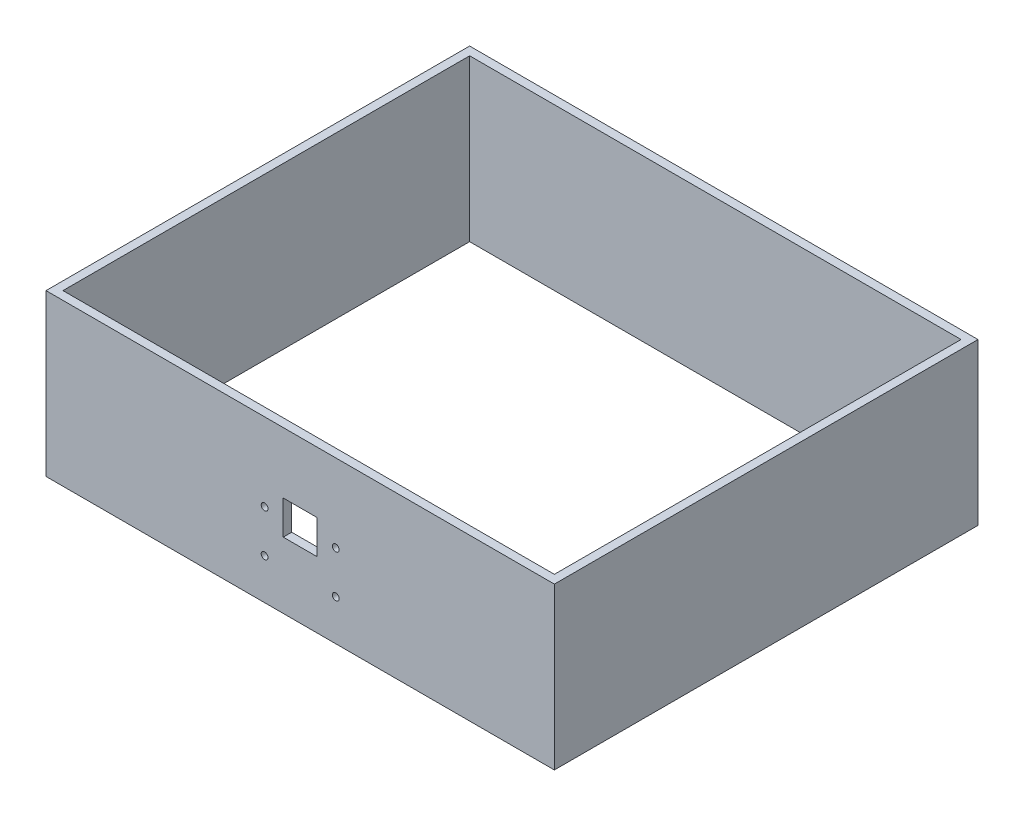
ISO-10303-21;
HEADER;
FILE_DESCRIPTION(('STEP AP214'),'2;1');
FILE_NAME('part.step','',(''),(''),'','','');
FILE_SCHEMA(('AUTOMOTIVE_DESIGN { 1 0 10303 214 1 1 1 1 }'));
ENDSEC;
DATA;
#1=APPLICATION_CONTEXT('core data for automotive mechanical design processes');
#2=APPLICATION_PROTOCOL_DEFINITION('international standard','automotive_design',2000,#1);
#3=PRODUCT_CONTEXT('',#1,'mechanical');
#4=PRODUCT('Part','Part','',(#3));
#5=PRODUCT_RELATED_PRODUCT_CATEGORY('part','',(#4));
#6=PRODUCT_DEFINITION_FORMATION('','',#4);
#7=PRODUCT_DEFINITION_CONTEXT('part definition',#1,'design');
#8=PRODUCT_DEFINITION('design','',#6,#7);
#9=PRODUCT_DEFINITION_SHAPE('','',#8);
#10=(LENGTH_UNIT() NAMED_UNIT(*) SI_UNIT(.MILLI.,.METRE.));
#11=(NAMED_UNIT(*) PLANE_ANGLE_UNIT() SI_UNIT($,.RADIAN.));
#12=(NAMED_UNIT(*) SI_UNIT($,.STERADIAN.) SOLID_ANGLE_UNIT());
#13=UNCERTAINTY_MEASURE_WITH_UNIT(LENGTH_MEASURE(1.E-05),#10,'distance_accuracy_value','');
#14=(GEOMETRIC_REPRESENTATION_CONTEXT(3) GLOBAL_UNCERTAINTY_ASSIGNED_CONTEXT((#13)) GLOBAL_UNIT_ASSIGNED_CONTEXT((#10,
#11,#12)) REPRESENTATION_CONTEXT('',''));
#15=CARTESIAN_POINT('',(0.,0.,0.));
#16=DIRECTION('',(0.,0.,1.));
#17=DIRECTION('',(1.,0.,0.));
#18=AXIS2_PLACEMENT_3D('',#15,#16,#17);
#19=CARTESIAN_POINT('',(0.,47.5,0.));
#20=DIRECTION('',(0.,1.,0.));
#21=DIRECTION('',(0.,0.,1.));
#22=AXIS2_PLACEMENT_3D('',#19,#20,#21);
#23=PLANE('',#22);
#24=DIRECTION('',(0.,0.,-1.));
#25=VECTOR('',#24,1.);
#26=CARTESIAN_POINT('',(-75.,47.5,0.));
#27=LINE('',#26,#25);
#28=CARTESIAN_POINT('',(-75.,47.5,62.5));
#29=VERTEX_POINT('',#28);
#30=CARTESIAN_POINT('',(-75.,47.5,-62.5));
#31=VERTEX_POINT('',#30);
#32=EDGE_CURVE('E248',#29,#31,#27,.T.);
#33=ORIENTED_EDGE('',*,*,#32,.F.);
#34=DIRECTION('',(1.,0.,0.));
#35=VECTOR('',#34,1.);
#36=CARTESIAN_POINT('',(0.,47.5,62.5));
#37=LINE('',#36,#35);
#38=CARTESIAN_POINT('',(75.,47.5,62.5));
#39=VERTEX_POINT('',#38);
#40=EDGE_CURVE('E252',#29,#39,#37,.T.);
#41=ORIENTED_EDGE('',*,*,#40,.T.);
#42=DIRECTION('',(0.,0.,-1.));
#43=VECTOR('',#42,1.);
#44=CARTESIAN_POINT('',(75.,47.5,0.));
#45=LINE('',#44,#43);
#46=CARTESIAN_POINT('',(75.,47.5,-62.5));
#47=VERTEX_POINT('',#46);
#48=EDGE_CURVE('E256',#39,#47,#45,.T.);
#49=ORIENTED_EDGE('',*,*,#48,.T.);
#50=DIRECTION('',(1.,0.,0.));
#51=VECTOR('',#50,1.);
#52=CARTESIAN_POINT('',(0.,47.5,-62.5));
#53=LINE('',#52,#51);
#54=EDGE_CURVE('E259',#31,#47,#53,.T.);
#55=ORIENTED_EDGE('',*,*,#54,.F.);
#56=EDGE_LOOP('',(#33,#41,#49,#55));
#57=FACE_BOUND('',#56,.T.);
#58=DIRECTION('',(1.,0.,0.));
#59=VECTOR('',#58,1.);
#60=CARTESIAN_POINT('',(0.,47.5,60.));
#61=LINE('',#60,#59);
#62=CARTESIAN_POINT('',(-72.5,47.5,60.));
#63=VERTEX_POINT('',#62);
#64=CARTESIAN_POINT('',(72.5,47.5,60.));
#65=VERTEX_POINT('',#64);
#66=EDGE_CURVE('E238',#63,#65,#61,.T.);
#67=ORIENTED_EDGE('',*,*,#66,.F.);
#68=DIRECTION('',(0.,0.,-1.));
#69=VECTOR('',#68,1.);
#70=CARTESIAN_POINT('',(-72.5,47.5,0.));
#71=LINE('',#70,#69);
#72=CARTESIAN_POINT('',(-72.5,47.5,-60.));
#73=VERTEX_POINT('',#72);
#74=EDGE_CURVE('E227',#63,#73,#71,.T.);
#75=ORIENTED_EDGE('',*,*,#74,.T.);
#76=DIRECTION('',(1.,0.,0.));
#77=VECTOR('',#76,1.);
#78=CARTESIAN_POINT('',(0.,47.5,-60.));
#79=LINE('',#78,#77);
#80=CARTESIAN_POINT('',(72.5,47.5,-60.));
#81=VERTEX_POINT('',#80);
#82=EDGE_CURVE('E213',#73,#81,#79,.T.);
#83=ORIENTED_EDGE('',*,*,#82,.T.);
#84=DIRECTION('',(0.,0.,-1.));
#85=VECTOR('',#84,1.);
#86=CARTESIAN_POINT('',(72.5,47.5,0.));
#87=LINE('',#86,#85);
#88=EDGE_CURVE('E241',#65,#81,#87,.T.);
#89=ORIENTED_EDGE('',*,*,#88,.F.);
#90=EDGE_LOOP('',(#67,#75,#83,#89));
#91=FACE_BOUND('',#90,.T.);
#92=ADVANCED_FACE('F38',(#57,#91),#23,.T.);
#93=CARTESIAN_POINT('',(0.,0.,0.));
#94=DIRECTION('',(0.,1.,0.));
#95=DIRECTION('',(0.,0.,1.));
#96=AXIS2_PLACEMENT_3D('',#93,#94,#95);
#97=PLANE('',#96);
#98=DIRECTION('',(0.,0.,-1.));
#99=VECTOR('',#98,1.);
#100=CARTESIAN_POINT('',(-75.,0.,0.));
#101=LINE('',#100,#99);
#102=CARTESIAN_POINT('',(-75.,0.,62.5));
#103=VERTEX_POINT('',#102);
#104=CARTESIAN_POINT('',(-75.,0.,-62.5));
#105=VERTEX_POINT('',#104);
#106=EDGE_CURVE('E207',#103,#105,#101,.T.);
#107=ORIENTED_EDGE('',*,*,#106,.T.);
#108=DIRECTION('',(1.,0.,0.));
#109=VECTOR('',#108,1.);
#110=CARTESIAN_POINT('',(0.,0.,-62.5));
#111=LINE('',#110,#109);
#112=CARTESIAN_POINT('',(75.,0.,-62.5));
#113=VERTEX_POINT('',#112);
#114=EDGE_CURVE('E253',#105,#113,#111,.T.);
#115=ORIENTED_EDGE('',*,*,#114,.T.);
#116=DIRECTION('',(0.,0.,-1.));
#117=VECTOR('',#116,1.);
#118=CARTESIAN_POINT('',(75.,0.,0.));
#119=LINE('',#118,#117);
#120=CARTESIAN_POINT('',(75.,0.,62.5));
#121=VERTEX_POINT('',#120);
#122=EDGE_CURVE('E270',#121,#113,#119,.T.);
#123=ORIENTED_EDGE('',*,*,#122,.F.);
#124=DIRECTION('',(1.,0.,0.));
#125=VECTOR('',#124,1.);
#126=CARTESIAN_POINT('',(0.,0.,62.5));
#127=LINE('',#126,#125);
#128=EDGE_CURVE('E267',#103,#121,#127,.T.);
#129=ORIENTED_EDGE('',*,*,#128,.F.);
#130=EDGE_LOOP('',(#107,#115,#123,#129));
#131=FACE_BOUND('',#130,.T.);
#132=DIRECTION('',(0.,0.,-1.));
#133=VECTOR('',#132,1.);
#134=CARTESIAN_POINT('',(-72.5,0.,0.));
#135=LINE('',#134,#133);
#136=CARTESIAN_POINT('',(-72.5,0.,60.));
#137=VERTEX_POINT('',#136);
#138=CARTESIAN_POINT('',(-72.5,0.,-60.));
#139=VERTEX_POINT('',#138);
#140=EDGE_CURVE('E200',#137,#139,#135,.T.);
#141=ORIENTED_EDGE('',*,*,#140,.F.);
#142=DIRECTION('',(1.,0.,0.));
#143=VECTOR('',#142,1.);
#144=CARTESIAN_POINT('',(0.,0.,60.));
#145=LINE('',#144,#143);
#146=CARTESIAN_POINT('',(72.5,0.,60.));
#147=VERTEX_POINT('',#146);
#148=EDGE_CURVE('E222',#137,#147,#145,.T.);
#149=ORIENTED_EDGE('',*,*,#148,.T.);
#150=DIRECTION('',(0.,0.,-1.));
#151=VECTOR('',#150,1.);
#152=CARTESIAN_POINT('',(72.5,0.,0.));
#153=LINE('',#152,#151);
#154=CARTESIAN_POINT('',(72.5,0.,-60.));
#155=VERTEX_POINT('',#154);
#156=EDGE_CURVE('E228',#147,#155,#153,.T.);
#157=ORIENTED_EDGE('',*,*,#156,.T.);
#158=DIRECTION('',(1.,0.,0.));
#159=VECTOR('',#158,1.);
#160=CARTESIAN_POINT('',(0.,0.,-60.));
#161=LINE('',#160,#159);
#162=EDGE_CURVE('E223',#139,#155,#161,.T.);
#163=ORIENTED_EDGE('',*,*,#162,.F.);
#164=EDGE_LOOP('',(#141,#149,#157,#163));
#165=FACE_BOUND('',#164,.T.);
#166=ADVANCED_FACE('F293',(#131,#165),#97,.F.);
#167=CARTESIAN_POINT('',(-75.,47.5,0.));
#168=DIRECTION('',(-1.,0.,0.));
#169=DIRECTION('',(0.,0.,1.));
#170=AXIS2_PLACEMENT_3D('',#167,#168,#169);
#171=PLANE('',#170);
#172=ORIENTED_EDGE('',*,*,#106,.F.);
#173=DIRECTION('',(0.,-1.,0.));
#174=VECTOR('',#173,1.);
#175=CARTESIAN_POINT('',(-75.,47.5,62.5));
#176=LINE('',#175,#174);
#177=EDGE_CURVE('E11',#29,#103,#176,.T.);
#178=ORIENTED_EDGE('',*,*,#177,.F.);
#179=ORIENTED_EDGE('',*,*,#32,.T.);
#180=DIRECTION('',(0.,-1.,0.));
#181=VECTOR('',#180,1.);
#182=CARTESIAN_POINT('',(-75.,47.5,-62.5));
#183=LINE('',#182,#181);
#184=EDGE_CURVE('E263',#31,#105,#183,.T.);
#185=ORIENTED_EDGE('',*,*,#184,.T.);
#186=EDGE_LOOP('',(#172,#178,#179,#185));
#187=FACE_BOUND('',#186,.T.);
#188=ADVANCED_FACE('F40',(#187),#171,.T.);
#189=CARTESIAN_POINT('',(0.,47.5,62.5));
#190=DIRECTION('',(0.,0.,-1.));
#191=DIRECTION('',(-1.,0.,0.));
#192=AXIS2_PLACEMENT_3D('',#189,#190,#191);
#193=PLANE('',#192);
#194=CARTESIAN_POINT('',(-10.5,24.5,62.5));
#195=DIRECTION('',(0.,0.,1.));
#196=DIRECTION('',(1.,0.,0.));
#197=AXIS2_PLACEMENT_3D('',#194,#195,#196);
#198=CIRCLE('',#197,1.);
#199=CARTESIAN_POINT('',(-9.49999999999999,24.5,62.5));
#200=VERTEX_POINT('',#199);
#201=EDGE_CURVE('E183',#200,#200,#198,.T.);
#202=ORIENTED_EDGE('',*,*,#201,.F.);
#203=EDGE_LOOP('',(#202));
#204=FACE_BOUND('',#203,.T.);
#205=CARTESIAN_POINT('',(10.5,12.,62.5));
#206=DIRECTION('',(0.,0.,1.));
#207=DIRECTION('',(-1.,0.,0.));
#208=AXIS2_PLACEMENT_3D('',#205,#206,#207);
#209=CIRCLE('',#208,1.);
#210=CARTESIAN_POINT('',(9.5,12.,62.5));
#211=VERTEX_POINT('',#210);
#212=EDGE_CURVE('E191',#211,#211,#209,.T.);
#213=ORIENTED_EDGE('',*,*,#212,.F.);
#214=EDGE_LOOP('',(#213));
#215=FACE_BOUND('',#214,.T.);
#216=CARTESIAN_POINT('',(10.5,24.5,62.5));
#217=DIRECTION('',(0.,0.,1.));
#218=DIRECTION('',(-1.,0.,0.));
#219=AXIS2_PLACEMENT_3D('',#216,#217,#218);
#220=CIRCLE('',#219,1.);
#221=CARTESIAN_POINT('',(9.49999999999999,24.5,62.5));
#222=VERTEX_POINT('',#221);
#223=EDGE_CURVE('E155',#222,#222,#220,.T.);
#224=ORIENTED_EDGE('',*,*,#223,.F.);
#225=EDGE_LOOP('',(#224));
#226=FACE_BOUND('',#225,.T.);
#227=DIRECTION('',(1.,0.,0.));
#228=VECTOR('',#227,1.);
#229=CARTESIAN_POINT('',(-5.,19.5,62.5));
#230=LINE('',#229,#228);
#231=CARTESIAN_POINT('',(-5.,19.5,62.5));
#232=VERTEX_POINT('',#231);
#233=CARTESIAN_POINT('',(5.,19.5,62.5));
#234=VERTEX_POINT('',#233);
#235=EDGE_CURVE('E164',#232,#234,#230,.T.);
#236=ORIENTED_EDGE('',*,*,#235,.F.);
#237=DIRECTION('',(0.,-1.,0.));
#238=VECTOR('',#237,1.);
#239=CARTESIAN_POINT('',(-5.,29.5,62.5));
#240=LINE('',#239,#238);
#241=CARTESIAN_POINT('',(-5.,29.5,62.5));
#242=VERTEX_POINT('',#241);
#243=EDGE_CURVE('E54',#242,#232,#240,.T.);
#244=ORIENTED_EDGE('',*,*,#243,.F.);
#245=DIRECTION('',(-1.,0.,0.));
#246=VECTOR('',#245,1.);
#247=CARTESIAN_POINT('',(-5.,29.5,62.5));
#248=LINE('',#247,#246);
#249=CARTESIAN_POINT('',(5.,29.5,62.5));
#250=VERTEX_POINT('',#249);
#251=EDGE_CURVE('E148',#250,#242,#248,.T.);
#252=ORIENTED_EDGE('',*,*,#251,.F.);
#253=DIRECTION('',(0.,1.,0.));
#254=VECTOR('',#253,1.);
#255=CARTESIAN_POINT('',(5.,29.5,62.5));
#256=LINE('',#255,#254);
#257=EDGE_CURVE('E152',#234,#250,#256,.T.);
#258=ORIENTED_EDGE('',*,*,#257,.F.);
#259=EDGE_LOOP('',(#236,#244,#252,#258));
#260=FACE_BOUND('',#259,.T.);
#261=CARTESIAN_POINT('',(-10.5,12.,62.5));
#262=DIRECTION('',(0.,0.,1.));
#263=DIRECTION('',(1.,0.,0.));
#264=AXIS2_PLACEMENT_3D('',#261,#262,#263);
#265=CIRCLE('',#264,1.);
#266=CARTESIAN_POINT('',(-9.49999999999999,12.,62.5));
#267=VERTEX_POINT('',#266);
#268=EDGE_CURVE('E182',#267,#267,#265,.T.);
#269=ORIENTED_EDGE('',*,*,#268,.F.);
#270=EDGE_LOOP('',(#269));
#271=FACE_BOUND('',#270,.T.);
#272=ORIENTED_EDGE('',*,*,#128,.T.);
#273=DIRECTION('',(0.,-1.,0.));
#274=VECTOR('',#273,1.);
#275=CARTESIAN_POINT('',(75.,47.5,62.5));
#276=LINE('',#275,#274);
#277=EDGE_CURVE('E47',#39,#121,#276,.T.);
#278=ORIENTED_EDGE('',*,*,#277,.F.);
#279=ORIENTED_EDGE('',*,*,#40,.F.);
#280=ORIENTED_EDGE('',*,*,#177,.T.);
#281=EDGE_LOOP('',(#272,#278,#279,#280));
#282=FACE_BOUND('',#281,.T.);
#283=ADVANCED_FACE('F303',(#204,#215,#226,#260,#271,#282),#193,.F.);
#284=CARTESIAN_POINT('',(75.,47.5,0.));
#285=DIRECTION('',(-1.,0.,0.));
#286=DIRECTION('',(0.,0.,1.));
#287=AXIS2_PLACEMENT_3D('',#284,#285,#286);
#288=PLANE('',#287);
#289=ORIENTED_EDGE('',*,*,#122,.T.);
#290=DIRECTION('',(0.,-1.,0.));
#291=VECTOR('',#290,1.);
#292=CARTESIAN_POINT('',(75.,47.5,-62.5));
#293=LINE('',#292,#291);
#294=EDGE_CURVE('E279',#47,#113,#293,.T.);
#295=ORIENTED_EDGE('',*,*,#294,.F.);
#296=ORIENTED_EDGE('',*,*,#48,.F.);
#297=ORIENTED_EDGE('',*,*,#277,.T.);
#298=EDGE_LOOP('',(#289,#295,#296,#297));
#299=FACE_BOUND('',#298,.T.);
#300=ADVANCED_FACE('F287',(#299),#288,.F.);
#301=CARTESIAN_POINT('',(0.,47.5,-62.5));
#302=DIRECTION('',(0.,0.,-1.));
#303=DIRECTION('',(-1.,0.,0.));
#304=AXIS2_PLACEMENT_3D('',#301,#302,#303);
#305=PLANE('',#304);
#306=ORIENTED_EDGE('',*,*,#114,.F.);
#307=ORIENTED_EDGE('',*,*,#184,.F.);
#308=ORIENTED_EDGE('',*,*,#54,.T.);
#309=ORIENTED_EDGE('',*,*,#294,.T.);
#310=EDGE_LOOP('',(#306,#307,#308,#309));
#311=FACE_BOUND('',#310,.T.);
#312=ADVANCED_FACE('F298',(#311),#305,.T.);
#313=CARTESIAN_POINT('',(-72.5,47.5,0.));
#314=DIRECTION('',(-1.,0.,0.));
#315=DIRECTION('',(0.,0.,1.));
#316=AXIS2_PLACEMENT_3D('',#313,#314,#315);
#317=PLANE('',#316);
#318=ORIENTED_EDGE('',*,*,#140,.T.);
#319=DIRECTION('',(0.,-1.,0.));
#320=VECTOR('',#319,1.);
#321=CARTESIAN_POINT('',(-72.5,47.5,-60.));
#322=LINE('',#321,#320);
#323=EDGE_CURVE('E209',#73,#139,#322,.T.);
#324=ORIENTED_EDGE('',*,*,#323,.F.);
#325=ORIENTED_EDGE('',*,*,#74,.F.);
#326=DIRECTION('',(0.,-1.,0.));
#327=VECTOR('',#326,1.);
#328=CARTESIAN_POINT('',(-72.5,47.5,60.));
#329=LINE('',#328,#327);
#330=EDGE_CURVE('E204',#63,#137,#329,.T.);
#331=ORIENTED_EDGE('',*,*,#330,.T.);
#332=EDGE_LOOP('',(#318,#324,#325,#331));
#333=FACE_BOUND('',#332,.T.);
#334=ADVANCED_FACE('F323',(#333),#317,.F.);
#335=CARTESIAN_POINT('',(0.,47.5,60.));
#336=DIRECTION('',(0.,0.,-1.));
#337=DIRECTION('',(-1.,0.,0.));
#338=AXIS2_PLACEMENT_3D('',#335,#336,#337);
#339=PLANE('',#338);
#340=CARTESIAN_POINT('',(-10.5,24.5,60.));
#341=DIRECTION('',(0.,0.,1.));
#342=DIRECTION('',(1.,0.,0.));
#343=AXIS2_PLACEMENT_3D('',#340,#341,#342);
#344=CIRCLE('',#343,1.);
#345=CARTESIAN_POINT('',(-9.49999999999999,24.5,60.));
#346=VERTEX_POINT('',#345);
#347=EDGE_CURVE('E178',#346,#346,#344,.T.);
#348=ORIENTED_EDGE('',*,*,#347,.T.);
#349=EDGE_LOOP('',(#348));
#350=FACE_BOUND('',#349,.T.);
#351=CARTESIAN_POINT('',(10.5,12.,60.));
#352=DIRECTION('',(0.,0.,1.));
#353=DIRECTION('',(-1.,0.,0.));
#354=AXIS2_PLACEMENT_3D('',#351,#352,#353);
#355=CIRCLE('',#354,1.);
#356=CARTESIAN_POINT('',(9.5,12.,60.));
#357=VERTEX_POINT('',#356);
#358=EDGE_CURVE('E187',#357,#357,#355,.T.);
#359=ORIENTED_EDGE('',*,*,#358,.T.);
#360=EDGE_LOOP('',(#359));
#361=FACE_BOUND('',#360,.T.);
#362=CARTESIAN_POINT('',(10.5,24.5,60.));
#363=DIRECTION('',(0.,0.,1.));
#364=DIRECTION('',(-1.,0.,0.));
#365=AXIS2_PLACEMENT_3D('',#362,#363,#364);
#366=CIRCLE('',#365,1.);
#367=CARTESIAN_POINT('',(9.49999999999999,24.5,60.));
#368=VERTEX_POINT('',#367);
#369=EDGE_CURVE('E195',#368,#368,#366,.T.);
#370=ORIENTED_EDGE('',*,*,#369,.T.);
#371=EDGE_LOOP('',(#370));
#372=FACE_BOUND('',#371,.T.);
#373=DIRECTION('',(0.,-1.,0.));
#374=VECTOR('',#373,1.);
#375=CARTESIAN_POINT('',(-5.,29.5,60.));
#376=LINE('',#375,#374);
#377=CARTESIAN_POINT('',(-5.,29.5,60.));
#378=VERTEX_POINT('',#377);
#379=CARTESIAN_POINT('',(-5.,19.5,60.));
#380=VERTEX_POINT('',#379);
#381=EDGE_CURVE('E129',#378,#380,#376,.T.);
#382=ORIENTED_EDGE('',*,*,#381,.T.);
#383=DIRECTION('',(1.,0.,0.));
#384=VECTOR('',#383,1.);
#385=CARTESIAN_POINT('',(-5.,19.5,60.));
#386=LINE('',#385,#384);
#387=CARTESIAN_POINT('',(5.,19.5,60.));
#388=VERTEX_POINT('',#387);
#389=EDGE_CURVE('E139',#380,#388,#386,.T.);
#390=ORIENTED_EDGE('',*,*,#389,.T.);
#391=DIRECTION('',(0.,1.,0.));
#392=VECTOR('',#391,1.);
#393=CARTESIAN_POINT('',(5.,29.5,60.));
#394=LINE('',#393,#392);
#395=CARTESIAN_POINT('',(5.,29.5,60.));
#396=VERTEX_POINT('',#395);
#397=EDGE_CURVE('E62',#388,#396,#394,.T.);
#398=ORIENTED_EDGE('',*,*,#397,.T.);
#399=DIRECTION('',(-1.,0.,0.));
#400=VECTOR('',#399,1.);
#401=CARTESIAN_POINT('',(-5.,29.5,60.));
#402=LINE('',#401,#400);
#403=EDGE_CURVE('E136',#396,#378,#402,.T.);
#404=ORIENTED_EDGE('',*,*,#403,.T.);
#405=EDGE_LOOP('',(#382,#390,#398,#404));
#406=FACE_BOUND('',#405,.T.);
#407=CARTESIAN_POINT('',(-10.5,12.,60.));
#408=DIRECTION('',(0.,0.,1.));
#409=DIRECTION('',(1.,0.,0.));
#410=AXIS2_PLACEMENT_3D('',#407,#408,#409);
#411=CIRCLE('',#410,1.);
#412=CARTESIAN_POINT('',(-9.49999999999999,12.,60.));
#413=VERTEX_POINT('',#412);
#414=EDGE_CURVE('E196',#413,#413,#411,.T.);
#415=ORIENTED_EDGE('',*,*,#414,.T.);
#416=EDGE_LOOP('',(#415));
#417=FACE_BOUND('',#416,.T.);
#418=ORIENTED_EDGE('',*,*,#148,.F.);
#419=ORIENTED_EDGE('',*,*,#330,.F.);
#420=ORIENTED_EDGE('',*,*,#66,.T.);
#421=DIRECTION('',(0.,-1.,0.));
#422=VECTOR('',#421,1.);
#423=CARTESIAN_POINT('',(72.5,47.5,60.));
#424=LINE('',#423,#422);
#425=EDGE_CURVE('E208',#65,#147,#424,.T.);
#426=ORIENTED_EDGE('',*,*,#425,.T.);
#427=EDGE_LOOP('',(#418,#419,#420,#426));
#428=FACE_BOUND('',#427,.T.);
#429=ADVANCED_FACE('F144',(#350,#361,#372,#406,#417,#428),#339,.T.);
#430=CARTESIAN_POINT('',(72.5,47.5,0.));
#431=DIRECTION('',(-1.,0.,0.));
#432=DIRECTION('',(0.,0.,1.));
#433=AXIS2_PLACEMENT_3D('',#430,#431,#432);
#434=PLANE('',#433);
#435=ORIENTED_EDGE('',*,*,#156,.F.);
#436=ORIENTED_EDGE('',*,*,#425,.F.);
#437=ORIENTED_EDGE('',*,*,#88,.T.);
#438=DIRECTION('',(0.,-1.,0.));
#439=VECTOR('',#438,1.);
#440=CARTESIAN_POINT('',(72.5,47.5,-60.));
#441=LINE('',#440,#439);
#442=EDGE_CURVE('E212',#81,#155,#441,.T.);
#443=ORIENTED_EDGE('',*,*,#442,.T.);
#444=EDGE_LOOP('',(#435,#436,#437,#443));
#445=FACE_BOUND('',#444,.T.);
#446=ADVANCED_FACE('F349',(#445),#434,.T.);
#447=CARTESIAN_POINT('',(0.,47.5,-60.));
#448=DIRECTION('',(0.,0.,-1.));
#449=DIRECTION('',(-1.,0.,0.));
#450=AXIS2_PLACEMENT_3D('',#447,#448,#449);
#451=PLANE('',#450);
#452=ORIENTED_EDGE('',*,*,#162,.T.);
#453=ORIENTED_EDGE('',*,*,#442,.F.);
#454=ORIENTED_EDGE('',*,*,#82,.F.);
#455=ORIENTED_EDGE('',*,*,#323,.T.);
#456=EDGE_LOOP('',(#452,#453,#454,#455));
#457=FACE_BOUND('',#456,.T.);
#458=ADVANCED_FACE('F318',(#457),#451,.F.);
#459=CARTESIAN_POINT('',(-10.5,12.,60.));
#460=DIRECTION('',(0.,0.,1.));
#461=DIRECTION('',(1.,0.,0.));
#462=AXIS2_PLACEMENT_3D('',#459,#460,#461);
#463=CYLINDRICAL_SURFACE('',#462,1.);
#464=ORIENTED_EDGE('',*,*,#414,.F.);
#465=EDGE_LOOP('',(#464));
#466=FACE_BOUND('',#465,.T.);
#467=ORIENTED_EDGE('',*,*,#268,.T.);
#468=EDGE_LOOP('',(#467));
#469=FACE_BOUND('',#468,.T.);
#470=ADVANCED_FACE('F365',(#466,#469),#463,.F.);
#471=CARTESIAN_POINT('',(-5.,29.5,60.));
#472=DIRECTION('',(-1.,0.,0.));
#473=DIRECTION('',(0.,-1.,0.));
#474=AXIS2_PLACEMENT_3D('',#471,#472,#473);
#475=PLANE('',#474);
#476=ORIENTED_EDGE('',*,*,#243,.T.);
#477=DIRECTION('',(0.,0.,1.));
#478=VECTOR('',#477,1.);
#479=CARTESIAN_POINT('',(-5.,19.5,60.));
#480=LINE('',#479,#478);
#481=EDGE_CURVE('E125',#380,#232,#480,.T.);
#482=ORIENTED_EDGE('',*,*,#481,.F.);
#483=ORIENTED_EDGE('',*,*,#381,.F.);
#484=DIRECTION('',(0.,0.,1.));
#485=VECTOR('',#484,1.);
#486=CARTESIAN_POINT('',(-5.,29.5,60.));
#487=LINE('',#486,#485);
#488=EDGE_CURVE('E170',#378,#242,#487,.T.);
#489=ORIENTED_EDGE('',*,*,#488,.T.);
#490=EDGE_LOOP('',(#476,#482,#483,#489));
#491=FACE_BOUND('',#490,.T.);
#492=ADVANCED_FACE('F127',(#491),#475,.F.);
#493=CARTESIAN_POINT('',(-5.,29.5,60.));
#494=DIRECTION('',(0.,1.,0.));
#495=DIRECTION('',(0.,0.,1.));
#496=AXIS2_PLACEMENT_3D('',#493,#494,#495);
#497=PLANE('',#496);
#498=ORIENTED_EDGE('',*,*,#251,.T.);
#499=ORIENTED_EDGE('',*,*,#488,.F.);
#500=ORIENTED_EDGE('',*,*,#403,.F.);
#501=DIRECTION('',(0.,0.,1.));
#502=VECTOR('',#501,1.);
#503=CARTESIAN_POINT('',(5.,29.5,60.));
#504=LINE('',#503,#502);
#505=EDGE_CURVE('E173',#396,#250,#504,.T.);
#506=ORIENTED_EDGE('',*,*,#505,.T.);
#507=EDGE_LOOP('',(#498,#499,#500,#506));
#508=FACE_BOUND('',#507,.T.);
#509=ADVANCED_FACE('F378',(#508),#497,.F.);
#510=CARTESIAN_POINT('',(5.,29.5,60.));
#511=DIRECTION('',(1.,0.,0.));
#512=DIRECTION('',(0.,1.,0.));
#513=AXIS2_PLACEMENT_3D('',#510,#511,#512);
#514=PLANE('',#513);
#515=ORIENTED_EDGE('',*,*,#257,.T.);
#516=ORIENTED_EDGE('',*,*,#505,.F.);
#517=ORIENTED_EDGE('',*,*,#397,.F.);
#518=DIRECTION('',(0.,0.,1.));
#519=VECTOR('',#518,1.);
#520=CARTESIAN_POINT('',(5.,19.5,60.));
#521=LINE('',#520,#519);
#522=EDGE_CURVE('E135',#388,#234,#521,.T.);
#523=ORIENTED_EDGE('',*,*,#522,.T.);
#524=EDGE_LOOP('',(#515,#516,#517,#523));
#525=FACE_BOUND('',#524,.T.);
#526=ADVANCED_FACE('F385',(#525),#514,.F.);
#527=CARTESIAN_POINT('',(-5.,19.5,60.));
#528=DIRECTION('',(0.,-1.,0.));
#529=DIRECTION('',(0.,0.,-1.));
#530=AXIS2_PLACEMENT_3D('',#527,#528,#529);
#531=PLANE('',#530);
#532=ORIENTED_EDGE('',*,*,#235,.T.);
#533=ORIENTED_EDGE('',*,*,#522,.F.);
#534=ORIENTED_EDGE('',*,*,#389,.F.);
#535=ORIENTED_EDGE('',*,*,#481,.T.);
#536=EDGE_LOOP('',(#532,#533,#534,#535));
#537=FACE_BOUND('',#536,.T.);
#538=ADVANCED_FACE('F140',(#537),#531,.F.);
#539=CARTESIAN_POINT('',(10.5,24.5,60.));
#540=DIRECTION('',(0.,0.,1.));
#541=DIRECTION('',(1.,0.,0.));
#542=AXIS2_PLACEMENT_3D('',#539,#540,#541);
#543=CYLINDRICAL_SURFACE('',#542,1.);
#544=ORIENTED_EDGE('',*,*,#369,.F.);
#545=EDGE_LOOP('',(#544));
#546=FACE_BOUND('',#545,.T.);
#547=ORIENTED_EDGE('',*,*,#223,.T.);
#548=EDGE_LOOP('',(#547));
#549=FACE_BOUND('',#548,.T.);
#550=ADVANCED_FACE('F399',(#546,#549),#543,.F.);
#551=CARTESIAN_POINT('',(10.5,12.,60.));
#552=DIRECTION('',(0.,0.,1.));
#553=DIRECTION('',(1.,0.,0.));
#554=AXIS2_PLACEMENT_3D('',#551,#552,#553);
#555=CYLINDRICAL_SURFACE('',#554,1.);
#556=ORIENTED_EDGE('',*,*,#358,.F.);
#557=EDGE_LOOP('',(#556));
#558=FACE_BOUND('',#557,.T.);
#559=ORIENTED_EDGE('',*,*,#212,.T.);
#560=EDGE_LOOP('',(#559));
#561=FACE_BOUND('',#560,.T.);
#562=ADVANCED_FACE('F406',(#558,#561),#555,.F.);
#563=CARTESIAN_POINT('',(-10.5,24.5,60.));
#564=DIRECTION('',(0.,0.,1.));
#565=DIRECTION('',(1.,0.,0.));
#566=AXIS2_PLACEMENT_3D('',#563,#564,#565);
#567=CYLINDRICAL_SURFACE('',#566,1.);
#568=ORIENTED_EDGE('',*,*,#347,.F.);
#569=EDGE_LOOP('',(#568));
#570=FACE_BOUND('',#569,.T.);
#571=ORIENTED_EDGE('',*,*,#201,.T.);
#572=EDGE_LOOP('',(#571));
#573=FACE_BOUND('',#572,.T.);
#574=ADVANCED_FACE('F414',(#570,#573),#567,.F.);
#575=CLOSED_SHELL('',(#92,#166,#188,#283,#300,#312,#334,#429,#446,#458,#470,#492,#509,#526,#538,
#550,#562,#574));
#576=MANIFOLD_SOLID_BREP('B2',#575);
#577=ADVANCED_BREP_SHAPE_REPRESENTATION('',(#18,#576),#14);
#578=SHAPE_DEFINITION_REPRESENTATION(#9,#577);
ENDSEC;
END-ISO-10303-21;
